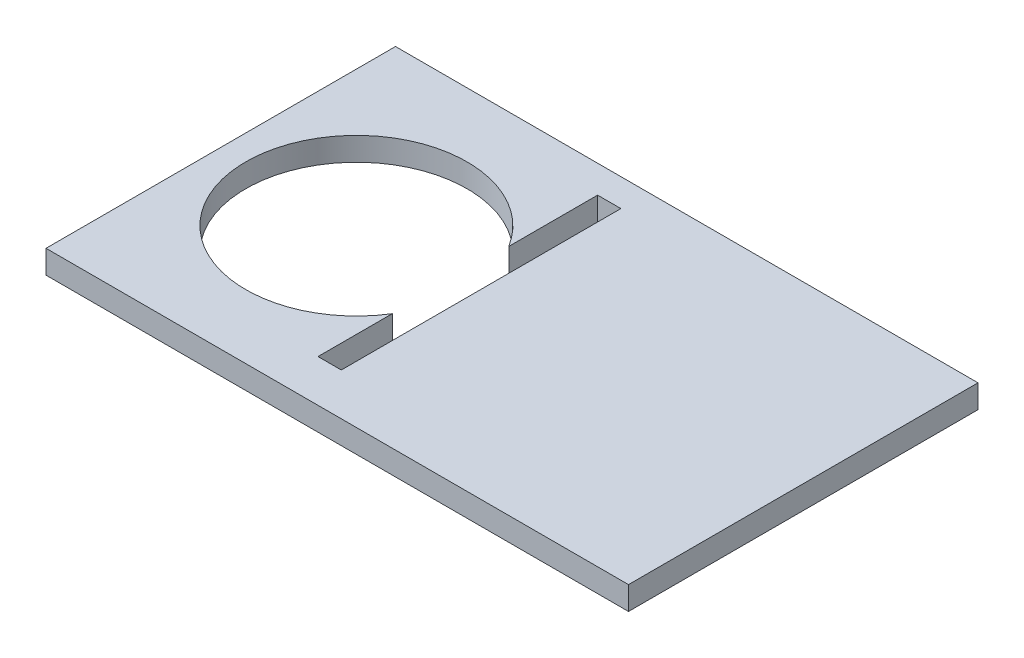
ISO-10303-21;
HEADER;
FILE_DESCRIPTION(('STEP AP214'),'2;1');
FILE_NAME('part.step','',(''),(''),'','','');
FILE_SCHEMA(('AUTOMOTIVE_DESIGN { 1 0 10303 214 1 1 1 1 }'));
ENDSEC;
DATA;
#1=APPLICATION_CONTEXT('core data for automotive mechanical design processes');
#2=APPLICATION_PROTOCOL_DEFINITION('international standard','automotive_design',2000,#1);
#3=PRODUCT_CONTEXT('',#1,'mechanical');
#4=PRODUCT('Part','Part','',(#3));
#5=PRODUCT_RELATED_PRODUCT_CATEGORY('part','',(#4));
#6=PRODUCT_DEFINITION_FORMATION('','',#4);
#7=PRODUCT_DEFINITION_CONTEXT('part definition',#1,'design');
#8=PRODUCT_DEFINITION('design','',#6,#7);
#9=PRODUCT_DEFINITION_SHAPE('','',#8);
#10=(LENGTH_UNIT() NAMED_UNIT(*) SI_UNIT(.MILLI.,.METRE.));
#11=(NAMED_UNIT(*) PLANE_ANGLE_UNIT() SI_UNIT($,.RADIAN.));
#12=(NAMED_UNIT(*) SI_UNIT($,.STERADIAN.) SOLID_ANGLE_UNIT());
#13=UNCERTAINTY_MEASURE_WITH_UNIT(LENGTH_MEASURE(1.E-05),#10,'distance_accuracy_value','');
#14=(GEOMETRIC_REPRESENTATION_CONTEXT(3) GLOBAL_UNCERTAINTY_ASSIGNED_CONTEXT((#13)) GLOBAL_UNIT_ASSIGNED_CONTEXT((#10,
#11,#12)) REPRESENTATION_CONTEXT('',''));
#15=CARTESIAN_POINT('',(0.,0.,0.));
#16=DIRECTION('',(0.,0.,1.));
#17=DIRECTION('',(1.,0.,0.));
#18=AXIS2_PLACEMENT_3D('',#15,#16,#17);
#19=CARTESIAN_POINT('',(63.5,0.,38.1));
#20=DIRECTION('',(0.,1.,0.));
#21=DIRECTION('',(0.,0.,1.));
#22=AXIS2_PLACEMENT_3D('',#19,#20,#21);
#23=PLANE('',#22);
#24=DIRECTION('',(0.,0.,-1.));
#25=VECTOR('',#24,1.);
#26=CARTESIAN_POINT('',(63.5,0.,-38.1));
#27=LINE('',#26,#25);
#28=CARTESIAN_POINT('',(63.5,0.,38.1));
#29=VERTEX_POINT('',#28);
#30=CARTESIAN_POINT('',(63.5,0.,-38.1));
#31=VERTEX_POINT('',#30);
#32=EDGE_CURVE('E156',#29,#31,#27,.T.);
#33=ORIENTED_EDGE('',*,*,#32,.F.);
#34=DIRECTION('',(1.,0.,0.));
#35=VECTOR('',#34,1.);
#36=CARTESIAN_POINT('',(-63.5,0.,38.1));
#37=LINE('',#36,#35);
#38=CARTESIAN_POINT('',(-63.5,0.,38.1));
#39=VERTEX_POINT('',#38);
#40=EDGE_CURVE('E80',#39,#29,#37,.T.);
#41=ORIENTED_EDGE('',*,*,#40,.F.);
#42=DIRECTION('',(0.,0.,1.));
#43=VECTOR('',#42,1.);
#44=CARTESIAN_POINT('',(-63.5,0.,-38.1));
#45=LINE('',#44,#43);
#46=CARTESIAN_POINT('',(-63.5,0.,-38.1));
#47=VERTEX_POINT('',#46);
#48=EDGE_CURVE('E170',#47,#39,#45,.T.);
#49=ORIENTED_EDGE('',*,*,#48,.F.);
#50=DIRECTION('',(-1.,0.,0.));
#51=VECTOR('',#50,1.);
#52=CARTESIAN_POINT('',(-63.5,0.,-38.1));
#53=LINE('',#52,#51);
#54=EDGE_CURVE('E168',#31,#47,#53,.T.);
#55=ORIENTED_EDGE('',*,*,#54,.F.);
#56=EDGE_LOOP('',(#33,#41,#49,#55));
#57=FACE_BOUND('',#56,.T.);
#58=CARTESIAN_POINT('',(-33.9253701986901,0.,0.));
#59=DIRECTION('',(0.,1.,0.));
#60=DIRECTION('',(0.,0.,1.));
#61=AXIS2_PLACEMENT_3D('',#58,#59,#60);
#62=CIRCLE('',#61,24.13);
#63=CARTESIAN_POINT('',(-13.4079592247985,-1.0752202050058E-13,-12.7001081463283));
#64=VERTEX_POINT('',#63);
#65=CARTESIAN_POINT('',(-13.4079592247985,0.,12.7001081463283));
#66=VERTEX_POINT('',#65);
#67=EDGE_CURVE('E148',#64,#66,#62,.T.);
#68=ORIENTED_EDGE('',*,*,#67,.T.);
#69=DIRECTION('',(0.,0.,1.));
#70=VECTOR('',#69,1.);
#71=CARTESIAN_POINT('',(-13.4079592247985,-1.04083408558608E-13,17.4625000000002));
#72=LINE('',#71,#70);
#73=CARTESIAN_POINT('',(-13.4079592247985,0.,28.8925000000002));
#74=VERTEX_POINT('',#73);
#75=EDGE_CURVE('E50',#66,#74,#72,.T.);
#76=ORIENTED_EDGE('',*,*,#75,.T.);
#77=DIRECTION('',(-1.,0.,0.));
#78=VECTOR('',#77,1.);
#79=CARTESIAN_POINT('',(63.5,0.,28.8925000000002));
#80=LINE('',#79,#78);
#81=CARTESIAN_POINT('',(-8.32795922479849,0.,28.8925000000002));
#82=VERTEX_POINT('',#81);
#83=EDGE_CURVE('E43',#82,#74,#80,.T.);
#84=ORIENTED_EDGE('',*,*,#83,.F.);
#85=DIRECTION('',(0.,0.,1.));
#86=VECTOR('',#85,1.);
#87=CARTESIAN_POINT('',(-8.32795922479848,0.,38.1));
#88=LINE('',#87,#86);
#89=CARTESIAN_POINT('',(-8.32795922479851,0.,-32.0674999999998));
#90=VERTEX_POINT('',#89);
#91=EDGE_CURVE('E186',#90,#82,#88,.T.);
#92=ORIENTED_EDGE('',*,*,#91,.F.);
#93=DIRECTION('',(1.,0.,0.));
#94=VECTOR('',#93,1.);
#95=CARTESIAN_POINT('',(63.5,0.,-32.0674999999998));
#96=LINE('',#95,#94);
#97=CARTESIAN_POINT('',(-13.4079592247985,0.,-32.0674999999998));
#98=VERTEX_POINT('',#97);
#99=EDGE_CURVE('E11',#98,#90,#96,.T.);
#100=ORIENTED_EDGE('',*,*,#99,.F.);
#101=DIRECTION('',(0.,0.,1.));
#102=VECTOR('',#101,1.);
#103=CARTESIAN_POINT('',(-13.4079592247985,0.,38.1));
#104=LINE('',#103,#102);
#105=EDGE_CURVE('E145',#98,#64,#104,.T.);
#106=ORIENTED_EDGE('',*,*,#105,.T.);
#107=EDGE_LOOP('',(#68,#76,#84,#92,#100,#106));
#108=FACE_BOUND('',#107,.T.);
#109=ADVANCED_FACE('F35',(#57,#108),#23,.F.);
#110=CARTESIAN_POINT('',(63.5,5.08,38.1));
#111=DIRECTION('',(0.,1.,0.));
#112=DIRECTION('',(0.,0.,1.));
#113=AXIS2_PLACEMENT_3D('',#110,#111,#112);
#114=PLANE('',#113);
#115=DIRECTION('',(0.,0.,1.));
#116=VECTOR('',#115,1.);
#117=CARTESIAN_POINT('',(-13.4079592247985,5.0799999999999,28.8925000000002));
#118=LINE('',#117,#116);
#119=CARTESIAN_POINT('',(-13.4079592247985,5.07999999999991,-32.0674999999998));
#120=VERTEX_POINT('',#119);
#121=CARTESIAN_POINT('',(-13.4079592247985,5.07999999999991,-12.7001081463283));
#122=VERTEX_POINT('',#121);
#123=EDGE_CURVE('E144',#120,#122,#118,.T.);
#124=ORIENTED_EDGE('',*,*,#123,.F.);
#125=DIRECTION('',(-1.,0.,0.));
#126=VECTOR('',#125,1.);
#127=CARTESIAN_POINT('',(-8.32795922479852,5.07999999999991,-32.0674999999998));
#128=LINE('',#127,#126);
#129=CARTESIAN_POINT('',(-8.32795922479852,5.07999999999991,-32.0674999999998));
#130=VERTEX_POINT('',#129);
#131=EDGE_CURVE('E127',#130,#120,#128,.T.);
#132=ORIENTED_EDGE('',*,*,#131,.F.);
#133=DIRECTION('',(0.,0.,1.));
#134=VECTOR('',#133,1.);
#135=CARTESIAN_POINT('',(-8.32795922479849,5.07999999999991,28.8925000000002));
#136=LINE('',#135,#134);
#137=CARTESIAN_POINT('',(-8.32795922479849,5.07999999999991,28.8925000000002));
#138=VERTEX_POINT('',#137);
#139=EDGE_CURVE('E131',#130,#138,#136,.T.);
#140=ORIENTED_EDGE('',*,*,#139,.T.);
#141=DIRECTION('',(-1.,0.,0.));
#142=VECTOR('',#141,1.);
#143=CARTESIAN_POINT('',(-8.32795922479849,5.07999999999991,28.8925000000002));
#144=LINE('',#143,#142);
#145=CARTESIAN_POINT('',(-13.4079592247985,5.0799999999999,28.8925000000002));
#146=VERTEX_POINT('',#145);
#147=EDGE_CURVE('E146',#138,#146,#144,.T.);
#148=ORIENTED_EDGE('',*,*,#147,.T.);
#149=CARTESIAN_POINT('',(-13.4079592247985,5.07999999999991,12.7001081463283));
#150=VERTEX_POINT('',#149);
#151=EDGE_CURVE('E195',#150,#146,#118,.T.);
#152=ORIENTED_EDGE('',*,*,#151,.F.);
#153=CARTESIAN_POINT('',(-33.9253701986901,5.08,0.));
#154=DIRECTION('',(0.,1.,0.));
#155=DIRECTION('',(0.,0.,1.));
#156=AXIS2_PLACEMENT_3D('',#153,#154,#155);
#157=CIRCLE('',#156,24.13);
#158=EDGE_CURVE('E153',#122,#150,#157,.T.);
#159=ORIENTED_EDGE('',*,*,#158,.F.);
#160=EDGE_LOOP('',(#124,#132,#140,#148,#152,#159));
#161=FACE_BOUND('',#160,.T.);
#162=DIRECTION('',(0.,0.,-1.));
#163=VECTOR('',#162,1.);
#164=CARTESIAN_POINT('',(63.5,5.08,-38.1));
#165=LINE('',#164,#163);
#166=CARTESIAN_POINT('',(63.5,5.08,38.1));
#167=VERTEX_POINT('',#166);
#168=CARTESIAN_POINT('',(63.5,5.08,-38.1));
#169=VERTEX_POINT('',#168);
#170=EDGE_CURVE('E159',#167,#169,#165,.T.);
#171=ORIENTED_EDGE('',*,*,#170,.T.);
#172=DIRECTION('',(-1.,0.,0.));
#173=VECTOR('',#172,1.);
#174=CARTESIAN_POINT('',(-63.5,5.08,-38.1));
#175=LINE('',#174,#173);
#176=CARTESIAN_POINT('',(-63.5,5.08,-38.1));
#177=VERTEX_POINT('',#176);
#178=EDGE_CURVE('E88',#169,#177,#175,.T.);
#179=ORIENTED_EDGE('',*,*,#178,.T.);
#180=DIRECTION('',(0.,0.,1.));
#181=VECTOR('',#180,1.);
#182=CARTESIAN_POINT('',(-63.5,5.08,-38.1));
#183=LINE('',#182,#181);
#184=CARTESIAN_POINT('',(-63.5,5.08,38.1));
#185=VERTEX_POINT('',#184);
#186=EDGE_CURVE('E162',#177,#185,#183,.T.);
#187=ORIENTED_EDGE('',*,*,#186,.T.);
#188=DIRECTION('',(1.,0.,0.));
#189=VECTOR('',#188,1.);
#190=CARTESIAN_POINT('',(-63.5,5.08,38.1));
#191=LINE('',#190,#189);
#192=EDGE_CURVE('E59',#185,#167,#191,.T.);
#193=ORIENTED_EDGE('',*,*,#192,.T.);
#194=EDGE_LOOP('',(#171,#179,#187,#193));
#195=FACE_BOUND('',#194,.T.);
#196=ADVANCED_FACE('F142',(#161,#195),#114,.T.);
#197=CARTESIAN_POINT('',(63.5,5.08,-38.1));
#198=DIRECTION('',(-1.,0.,0.));
#199=DIRECTION('',(0.,0.,1.));
#200=AXIS2_PLACEMENT_3D('',#197,#198,#199);
#201=PLANE('',#200);
#202=ORIENTED_EDGE('',*,*,#32,.T.);
#203=DIRECTION('',(0.,-1.,0.));
#204=VECTOR('',#203,1.);
#205=CARTESIAN_POINT('',(63.5,5.08,-38.1));
#206=LINE('',#205,#204);
#207=EDGE_CURVE('E179',#169,#31,#206,.T.);
#208=ORIENTED_EDGE('',*,*,#207,.F.);
#209=ORIENTED_EDGE('',*,*,#170,.F.);
#210=DIRECTION('',(0.,-1.,0.));
#211=VECTOR('',#210,1.);
#212=CARTESIAN_POINT('',(63.5,5.08,38.1));
#213=LINE('',#212,#211);
#214=EDGE_CURVE('E165',#167,#29,#213,.T.);
#215=ORIENTED_EDGE('',*,*,#214,.T.);
#216=EDGE_LOOP('',(#202,#208,#209,#215));
#217=FACE_BOUND('',#216,.T.);
#218=ADVANCED_FACE('F37',(#217),#201,.F.);
#219=CARTESIAN_POINT('',(-63.5,5.08,-38.1));
#220=DIRECTION('',(0.,0.,1.));
#221=DIRECTION('',(1.,0.,0.));
#222=AXIS2_PLACEMENT_3D('',#219,#220,#221);
#223=PLANE('',#222);
#224=ORIENTED_EDGE('',*,*,#54,.T.);
#225=DIRECTION('',(0.,-1.,0.));
#226=VECTOR('',#225,1.);
#227=CARTESIAN_POINT('',(-63.5,5.08,-38.1));
#228=LINE('',#227,#226);
#229=EDGE_CURVE('E176',#177,#47,#228,.T.);
#230=ORIENTED_EDGE('',*,*,#229,.F.);
#231=ORIENTED_EDGE('',*,*,#178,.F.);
#232=ORIENTED_EDGE('',*,*,#207,.T.);
#233=EDGE_LOOP('',(#224,#230,#231,#232));
#234=FACE_BOUND('',#233,.T.);
#235=ADVANCED_FACE('F231',(#234),#223,.F.);
#236=CARTESIAN_POINT('',(-63.5,5.08,-38.1));
#237=DIRECTION('',(1.,0.,0.));
#238=DIRECTION('',(0.,0.,-1.));
#239=AXIS2_PLACEMENT_3D('',#236,#237,#238);
#240=PLANE('',#239);
#241=ORIENTED_EDGE('',*,*,#48,.T.);
#242=DIRECTION('',(0.,-1.,0.));
#243=VECTOR('',#242,1.);
#244=CARTESIAN_POINT('',(-63.5,5.08,38.1));
#245=LINE('',#244,#243);
#246=EDGE_CURVE('E174',#185,#39,#245,.T.);
#247=ORIENTED_EDGE('',*,*,#246,.F.);
#248=ORIENTED_EDGE('',*,*,#186,.F.);
#249=ORIENTED_EDGE('',*,*,#229,.T.);
#250=EDGE_LOOP('',(#241,#247,#248,#249));
#251=FACE_BOUND('',#250,.T.);
#252=ADVANCED_FACE('F229',(#251),#240,.F.);
#253=CARTESIAN_POINT('',(-63.5,5.08,38.1));
#254=DIRECTION('',(0.,0.,-1.));
#255=DIRECTION('',(-1.,0.,0.));
#256=AXIS2_PLACEMENT_3D('',#253,#254,#255);
#257=PLANE('',#256);
#258=ORIENTED_EDGE('',*,*,#40,.T.);
#259=ORIENTED_EDGE('',*,*,#214,.F.);
#260=ORIENTED_EDGE('',*,*,#192,.F.);
#261=ORIENTED_EDGE('',*,*,#246,.T.);
#262=EDGE_LOOP('',(#258,#259,#260,#261));
#263=FACE_BOUND('',#262,.T.);
#264=ADVANCED_FACE('F226',(#263),#257,.F.);
#265=CARTESIAN_POINT('',(-33.9253701986901,5.08,0.));
#266=DIRECTION('',(0.,-1.,0.));
#267=DIRECTION('',(0.,0.,-1.));
#268=AXIS2_PLACEMENT_3D('',#265,#266,#267);
#269=CYLINDRICAL_SURFACE('',#268,24.13);
#270=DIRECTION('',(0.,-1.,0.));
#271=VECTOR('',#270,1.);
#272=CARTESIAN_POINT('',(-13.4079592247985,5.08000000000001,-12.7001081463283));
#273=LINE('',#272,#271);
#274=EDGE_CURVE('E183',#122,#64,#273,.T.);
#275=ORIENTED_EDGE('',*,*,#274,.F.);
#276=ORIENTED_EDGE('',*,*,#158,.T.);
#277=DIRECTION('',(0.,-1.,0.));
#278=VECTOR('',#277,1.);
#279=CARTESIAN_POINT('',(-13.4079592247985,5.08000000000001,12.7001081463283));
#280=LINE('',#279,#278);
#281=EDGE_CURVE('E181',#66,#150,#280,.F.);
#282=ORIENTED_EDGE('',*,*,#281,.F.);
#283=ORIENTED_EDGE('',*,*,#67,.F.);
#284=EDGE_LOOP('',(#275,#276,#282,#283));
#285=FACE_BOUND('',#284,.T.);
#286=ADVANCED_FACE('F204',(#285),#269,.F.);
#287=CARTESIAN_POINT('',(-8.32795922479847,-101.6,-32.0674999999998));
#288=DIRECTION('',(-1.,0.,0.));
#289=DIRECTION('',(0.,0.,1.));
#290=AXIS2_PLACEMENT_3D('',#287,#288,#289);
#291=PLANE('',#290);
#292=DIRECTION('',(0.,1.,0.));
#293=VECTOR('',#292,1.);
#294=CARTESIAN_POINT('',(-8.32795922479852,5.07999999999991,-32.0674999999998));
#295=LINE('',#294,#293);
#296=EDGE_CURVE('E122',#90,#130,#295,.T.);
#297=ORIENTED_EDGE('',*,*,#296,.F.);
#298=ORIENTED_EDGE('',*,*,#91,.T.);
#299=DIRECTION('',(0.,-1.,0.));
#300=VECTOR('',#299,1.);
#301=CARTESIAN_POINT('',(-8.32795922479849,5.07999999999991,28.8925000000002));
#302=LINE('',#301,#300);
#303=EDGE_CURVE('E138',#138,#82,#302,.T.);
#304=ORIENTED_EDGE('',*,*,#303,.F.);
#305=ORIENTED_EDGE('',*,*,#139,.F.);
#306=EDGE_LOOP('',(#297,#298,#304,#305));
#307=FACE_BOUND('',#306,.T.);
#308=ADVANCED_FACE('F136',(#307),#291,.T.);
#309=CARTESIAN_POINT('',(-8.32795922479852,5.07999999999991,-32.0674999999998));
#310=DIRECTION('',(0.,0.,1.));
#311=DIRECTION('',(0.,-1.,0.));
#312=AXIS2_PLACEMENT_3D('',#309,#310,#311);
#313=PLANE('',#312);
#314=ORIENTED_EDGE('',*,*,#99,.T.);
#315=ORIENTED_EDGE('',*,*,#296,.T.);
#316=ORIENTED_EDGE('',*,*,#131,.T.);
#317=DIRECTION('',(0.,1.,0.));
#318=VECTOR('',#317,1.);
#319=CARTESIAN_POINT('',(-13.4079592247985,5.07999999999991,-32.0674999999998));
#320=LINE('',#319,#318);
#321=EDGE_CURVE('E198',#98,#120,#320,.T.);
#322=ORIENTED_EDGE('',*,*,#321,.F.);
#323=EDGE_LOOP('',(#314,#315,#316,#322));
#324=FACE_BOUND('',#323,.T.);
#325=ADVANCED_FACE('F124',(#324),#313,.T.);
#326=CARTESIAN_POINT('',(-8.32795922479849,5.07999999999991,28.8925000000002));
#327=DIRECTION('',(0.,0.,-1.));
#328=DIRECTION('',(0.,1.,0.));
#329=AXIS2_PLACEMENT_3D('',#326,#327,#328);
#330=PLANE('',#329);
#331=ORIENTED_EDGE('',*,*,#83,.T.);
#332=DIRECTION('',(0.,-1.,0.));
#333=VECTOR('',#332,1.);
#334=CARTESIAN_POINT('',(-13.4079592247985,5.0799999999999,28.8925000000002));
#335=LINE('',#334,#333);
#336=EDGE_CURVE('E132',#146,#74,#335,.T.);
#337=ORIENTED_EDGE('',*,*,#336,.F.);
#338=ORIENTED_EDGE('',*,*,#147,.F.);
#339=ORIENTED_EDGE('',*,*,#303,.T.);
#340=EDGE_LOOP('',(#331,#337,#338,#339));
#341=FACE_BOUND('',#340,.T.);
#342=ADVANCED_FACE('F191',(#341),#330,.T.);
#343=CARTESIAN_POINT('',(-13.4079592247985,-101.6,-32.0674999999998));
#344=DIRECTION('',(-1.,0.,0.));
#345=DIRECTION('',(0.,0.,1.));
#346=AXIS2_PLACEMENT_3D('',#343,#344,#345);
#347=PLANE('',#346);
#348=ORIENTED_EDGE('',*,*,#321,.T.);
#349=ORIENTED_EDGE('',*,*,#123,.T.);
#350=ORIENTED_EDGE('',*,*,#274,.T.);
#351=ORIENTED_EDGE('',*,*,#105,.F.);
#352=EDGE_LOOP('',(#348,#349,#350,#351));
#353=FACE_BOUND('',#352,.T.);
#354=ADVANCED_FACE('F206',(#353),#347,.F.);
#355=ORIENTED_EDGE('',*,*,#75,.F.);
#356=ORIENTED_EDGE('',*,*,#281,.T.);
#357=ORIENTED_EDGE('',*,*,#151,.T.);
#358=ORIENTED_EDGE('',*,*,#336,.T.);
#359=EDGE_LOOP('',(#355,#356,#357,#358));
#360=FACE_BOUND('',#359,.T.);
#361=ADVANCED_FACE('F193',(#360),#347,.F.);
#362=CLOSED_SHELL('',(#109,#196,#218,#235,#252,#264,#286,#308,#325,#342,#354,#361));
#363=MANIFOLD_SOLID_BREP('B2',#362);
#364=ADVANCED_BREP_SHAPE_REPRESENTATION('',(#18,#363),#14);
#365=SHAPE_DEFINITION_REPRESENTATION(#9,#364);
ENDSEC;
END-ISO-10303-21;
